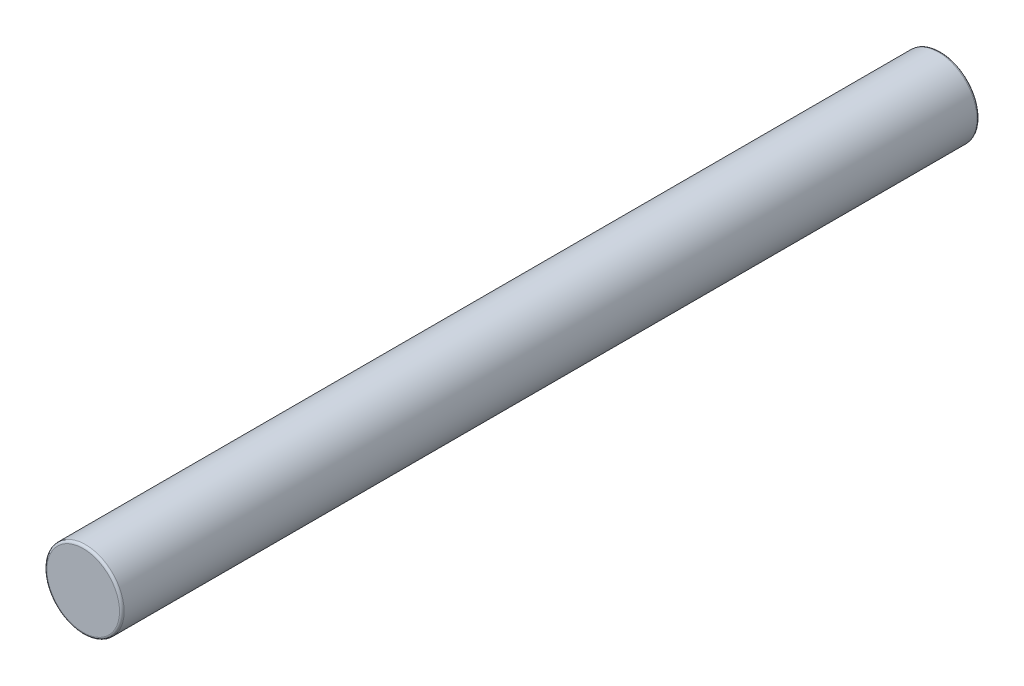
ISO-10303-21;
HEADER;
FILE_DESCRIPTION(('STEP AP214'),'2;1');
FILE_NAME('part.step','',(''),(''),'','','');
FILE_SCHEMA(('AUTOMOTIVE_DESIGN { 1 0 10303 214 1 1 1 1 }'));
ENDSEC;
DATA;
#1=APPLICATION_CONTEXT('core data for automotive mechanical design processes');
#2=APPLICATION_PROTOCOL_DEFINITION('international standard','automotive_design',2000,#1);
#3=PRODUCT_CONTEXT('',#1,'mechanical');
#4=PRODUCT('Part','Part','',(#3));
#5=PRODUCT_RELATED_PRODUCT_CATEGORY('part','',(#4));
#6=PRODUCT_DEFINITION_FORMATION('','',#4);
#7=PRODUCT_DEFINITION_CONTEXT('part definition',#1,'design');
#8=PRODUCT_DEFINITION('design','',#6,#7);
#9=PRODUCT_DEFINITION_SHAPE('','',#8);
#10=(LENGTH_UNIT() NAMED_UNIT(*) SI_UNIT(.MILLI.,.METRE.));
#11=(NAMED_UNIT(*) PLANE_ANGLE_UNIT() SI_UNIT($,.RADIAN.));
#12=(NAMED_UNIT(*) SI_UNIT($,.STERADIAN.) SOLID_ANGLE_UNIT());
#13=UNCERTAINTY_MEASURE_WITH_UNIT(LENGTH_MEASURE(1.E-05),#10,'distance_accuracy_value','');
#14=(GEOMETRIC_REPRESENTATION_CONTEXT(3) GLOBAL_UNCERTAINTY_ASSIGNED_CONTEXT((#13)) GLOBAL_UNIT_ASSIGNED_CONTEXT((#10,
#11,#12)) REPRESENTATION_CONTEXT('',''));
#15=CARTESIAN_POINT('',(0.,0.,0.));
#16=DIRECTION('',(0.,0.,1.));
#17=DIRECTION('',(1.,0.,0.));
#18=AXIS2_PLACEMENT_3D('',#15,#16,#17);
#19=CARTESIAN_POINT('',(0.,0.,55.5));
#20=DIRECTION('',(0.,0.,-1.));
#21=DIRECTION('',(-1.,0.,0.));
#22=AXIS2_PLACEMENT_3D('',#19,#20,#21);
#23=CYLINDRICAL_SURFACE('',#22,5.);
#24=CARTESIAN_POINT('',(0.,0.,55.2));
#25=DIRECTION('',(0.,0.,1.));
#26=DIRECTION('',(1.,0.,0.));
#27=AXIS2_PLACEMENT_3D('',#24,#25,#26);
#28=CIRCLE('',#27,5.);
#29=CARTESIAN_POINT('',(5.,0.,55.2));
#30=VERTEX_POINT('',#29);
#31=EDGE_CURVE('E38',#30,#30,#28,.F.);
#32=ORIENTED_EDGE('',*,*,#31,.T.);
#33=EDGE_LOOP('',(#32));
#34=FACE_BOUND('',#33,.T.);
#35=CARTESIAN_POINT('',(0.,0.,-55.2));
#36=DIRECTION('',(0.,0.,1.));
#37=DIRECTION('',(1.,0.,0.));
#38=AXIS2_PLACEMENT_3D('',#35,#36,#37);
#39=CIRCLE('',#38,5.);
#40=CARTESIAN_POINT('',(5.,0.,-55.2));
#41=VERTEX_POINT('',#40);
#42=EDGE_CURVE('E42',#41,#41,#39,.T.);
#43=ORIENTED_EDGE('',*,*,#42,.T.);
#44=EDGE_LOOP('',(#43));
#45=FACE_BOUND('',#44,.T.);
#46=ADVANCED_FACE('F31',(#34,#45),#23,.T.);
#47=CARTESIAN_POINT('',(0.,0.,55.5));
#48=DIRECTION('',(0.,0.,1.));
#49=DIRECTION('',(1.,0.,0.));
#50=AXIS2_PLACEMENT_3D('',#47,#48,#49);
#51=PLANE('',#50);
#52=CARTESIAN_POINT('',(0.,0.,55.5));
#53=DIRECTION('',(0.,0.,1.));
#54=DIRECTION('',(1.,0.,0.));
#55=AXIS2_PLACEMENT_3D('',#52,#53,#54);
#56=CIRCLE('',#55,4.7);
#57=CARTESIAN_POINT('',(4.7,0.,55.5));
#58=VERTEX_POINT('',#57);
#59=EDGE_CURVE('E46',#58,#58,#56,.T.);
#60=ORIENTED_EDGE('',*,*,#59,.T.);
#61=EDGE_LOOP('',(#60));
#62=FACE_BOUND('',#61,.T.);
#63=ADVANCED_FACE('F52',(#62),#51,.T.);
#64=CARTESIAN_POINT('',(0.,0.,-55.5));
#65=DIRECTION('',(0.,0.,1.));
#66=DIRECTION('',(1.,0.,0.));
#67=AXIS2_PLACEMENT_3D('',#64,#65,#66);
#68=PLANE('',#67);
#69=CARTESIAN_POINT('',(0.,0.,-55.5));
#70=DIRECTION('',(0.,0.,1.));
#71=DIRECTION('',(1.,0.,0.));
#72=AXIS2_PLACEMENT_3D('',#69,#70,#71);
#73=CIRCLE('',#72,4.7);
#74=CARTESIAN_POINT('',(4.7,0.,-55.5));
#75=VERTEX_POINT('',#74);
#76=EDGE_CURVE('E10',#75,#75,#73,.F.);
#77=ORIENTED_EDGE('',*,*,#76,.T.);
#78=EDGE_LOOP('',(#77));
#79=FACE_BOUND('',#78,.T.);
#80=ADVANCED_FACE('F56',(#79),#68,.F.);
#81=CARTESIAN_POINT('',(0.,0.,55.2));
#82=DIRECTION('',(0.,0.,1.));
#83=DIRECTION('',(1.,0.,0.));
#84=AXIS2_PLACEMENT_3D('',#81,#82,#83);
#85=TOROIDAL_SURFACE('',#84,4.7,0.3);
#86=ORIENTED_EDGE('',*,*,#31,.F.);
#87=EDGE_LOOP('',(#86));
#88=FACE_BOUND('',#87,.T.);
#89=ORIENTED_EDGE('',*,*,#59,.F.);
#90=EDGE_LOOP('',(#89));
#91=FACE_BOUND('',#90,.T.);
#92=ADVANCED_FACE('F54',(#88,#91),#85,.T.);
#93=CARTESIAN_POINT('',(0.,0.,-55.2));
#94=DIRECTION('',(0.,0.,1.));
#95=DIRECTION('',(1.,0.,0.));
#96=AXIS2_PLACEMENT_3D('',#93,#94,#95);
#97=TOROIDAL_SURFACE('',#96,4.7,0.3);
#98=ORIENTED_EDGE('',*,*,#76,.F.);
#99=EDGE_LOOP('',(#98));
#100=FACE_BOUND('',#99,.T.);
#101=ORIENTED_EDGE('',*,*,#42,.F.);
#102=EDGE_LOOP('',(#101));
#103=FACE_BOUND('',#102,.T.);
#104=ADVANCED_FACE('F33',(#100,#103),#97,.T.);
#105=CLOSED_SHELL('',(#46,#63,#80,#92,#104));
#106=MANIFOLD_SOLID_BREP('B2',#105);
#107=ADVANCED_BREP_SHAPE_REPRESENTATION('',(#18,#106),#14);
#108=SHAPE_DEFINITION_REPRESENTATION(#9,#107);
ENDSEC;
END-ISO-10303-21;
